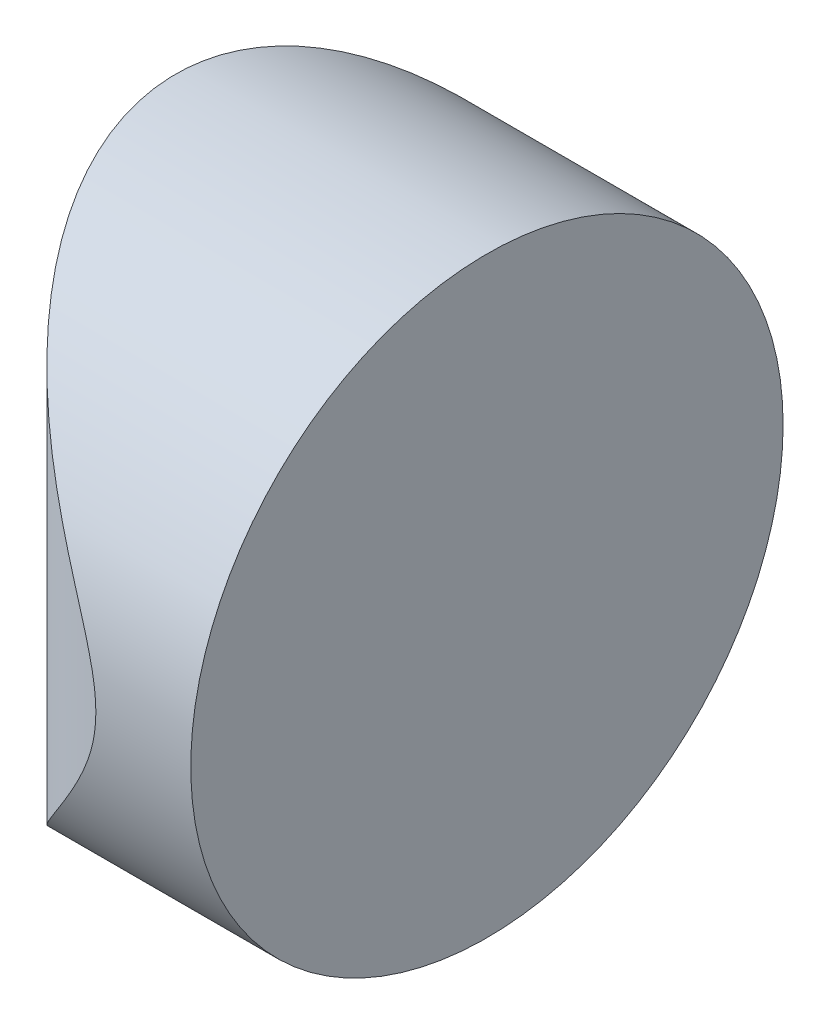
ISO-10303-21;
HEADER;
FILE_DESCRIPTION(('STEP AP214'),'2;1');
FILE_NAME('part.step','',(''),(''),'','','');
FILE_SCHEMA(('AUTOMOTIVE_DESIGN { 1 0 10303 214 1 1 1 1 }'));
ENDSEC;
DATA;
#1=APPLICATION_CONTEXT('core data for automotive mechanical design processes');
#2=APPLICATION_PROTOCOL_DEFINITION('international standard','automotive_design',2000,#1);
#3=PRODUCT_CONTEXT('',#1,'mechanical');
#4=PRODUCT('Part','Part','',(#3));
#5=PRODUCT_RELATED_PRODUCT_CATEGORY('part','',(#4));
#6=PRODUCT_DEFINITION_FORMATION('','',#4);
#7=PRODUCT_DEFINITION_CONTEXT('part definition',#1,'design');
#8=PRODUCT_DEFINITION('design','',#6,#7);
#9=PRODUCT_DEFINITION_SHAPE('','',#8);
#10=(LENGTH_UNIT() NAMED_UNIT(*) SI_UNIT(.MILLI.,.METRE.));
#11=(NAMED_UNIT(*) PLANE_ANGLE_UNIT() SI_UNIT($,.RADIAN.));
#12=(NAMED_UNIT(*) SI_UNIT($,.STERADIAN.) SOLID_ANGLE_UNIT());
#13=UNCERTAINTY_MEASURE_WITH_UNIT(LENGTH_MEASURE(1.E-05),#10,'distance_accuracy_value','');
#14=(GEOMETRIC_REPRESENTATION_CONTEXT(3) GLOBAL_UNCERTAINTY_ASSIGNED_CONTEXT((#13)) GLOBAL_UNIT_ASSIGNED_CONTEXT((#10,
#11,#12)) REPRESENTATION_CONTEXT('',''));
#15=CARTESIAN_POINT('',(0.,0.,0.));
#16=DIRECTION('',(0.,0.,1.));
#17=DIRECTION('',(1.,0.,0.));
#18=AXIS2_PLACEMENT_3D('',#15,#16,#17);
#19=CARTESIAN_POINT('',(4.35520433485127,12.5,0.));
#20=DIRECTION('',(0.,-1.,0.));
#21=DIRECTION('',(0.,0.,-1.));
#22=AXIS2_PLACEMENT_3D('',#19,#20,#21);
#23=CYLINDRICAL_SURFACE('',#22,6.56000000000001);
#24=CARTESIAN_POINT('',(-2.20479566514874,0.,0.));
#25=CARTESIAN_POINT('',(-2.20479625291368,-5.92082555034689E-07,-0.142059010534018));
#26=CARTESIAN_POINT('',(-2.20017270893054,0.0048517407394715,-0.284111139242209));
#27=CARTESIAN_POINT('',(-2.18178602671174,0.024154542778671,-0.566956263310266));
#28=CARTESIAN_POINT('',(-2.16802339820734,0.0386044766909083,-0.707749328450406));
#29=CARTESIAN_POINT('',(-2.13165689488844,0.0768077298210396,-0.986943918142709));
#30=CARTESIAN_POINT('',(-2.10905032856488,0.100563881238307,-1.12534470124092));
#31=CARTESIAN_POINT('',(-2.05546761630831,0.156914510420785,-1.39867286402107));
#32=CARTESIAN_POINT('',(-2.02449116703289,0.18950930851757,-1.53360011762072));
#33=CARTESIAN_POINT('',(-1.95498715422773,0.262717791689279,-1.79824156860047));
#34=CARTESIAN_POINT('',(-1.91651066700604,0.303277249443726,-1.92798424710068));
#35=CARTESIAN_POINT('',(-1.83253289145249,0.39191229783334,-2.18254493964299));
#36=CARTESIAN_POINT('',(-1.78702898841073,0.43999068614221,-2.30736109886902));
#37=CARTESIAN_POINT('',(-1.6409926641342,0.594522590574616,-2.67360661982806));
#38=CARTESIAN_POINT('',(-1.53088768078723,0.711323194513612,-2.90701036703629));
#39=CARTESIAN_POINT('',(-1.32633142605432,0.929312754208702,-3.28409827417413));
#40=CARTESIAN_POINT('',(-1.23687499713673,1.02490927918516,-3.4339077251197));
#41=CARTESIAN_POINT('',(-1.04973115363213,1.22570366780926,-3.72151434707834));
#42=CARTESIAN_POINT('',(-0.952043007877265,1.33090238442398,-3.85931044881028));
#43=CARTESIAN_POINT('',(-0.749736254200656,1.54988467663983,-4.12321689352803));
#44=CARTESIAN_POINT('',(-0.645099370449452,1.66369100971784,-4.24929414456034));
#45=CARTESIAN_POINT('',(-0.430562576921207,1.89859238469098,-4.48953998130713));
#46=CARTESIAN_POINT('',(-0.320663070208145,2.01968686856896,-4.60370947691408));
#47=CARTESIAN_POINT('',(-0.061724065976652,2.30750159283398,-4.85450663335686));
#48=CARTESIAN_POINT('',(0.0887631451208692,2.47660217664253,-4.98691864180841));
#49=CARTESIAN_POINT('',(0.393679043523268,2.82513189042638,-5.23242417594022));
#50=CARTESIAN_POINT('',(0.548110462807381,3.00456829384401,-5.34550386959853));
#51=CARTESIAN_POINT('',(0.857230881446924,3.37337256471669,-5.55267908779364));
#52=CARTESIAN_POINT('',(1.01191910551686,3.56272453597041,-5.64680389284216));
#53=CARTESIAN_POINT('',(1.24042360018869,3.85533951430507,-5.77402508065761));
#54=CARTESIAN_POINT('',(1.31597386269347,3.95426714710162,-5.814091050307));
#55=CARTESIAN_POINT('',(1.46493223882529,4.15544804455678,-5.88955792383036));
#56=CARTESIAN_POINT('',(1.53834071170594,4.25770074532897,-5.92495961361171));
#57=CARTESIAN_POINT('',(1.71027980314714,4.50763659112804,-6.0041740349912));
#58=CARTESIAN_POINT('',(1.80716875437467,4.65719076549025,-6.04571942074678));
#59=CARTESIAN_POINT('',(1.98811089818935,4.96633689991167,-6.11881538167238));
#60=CARTESIAN_POINT('',(2.07218078351492,5.12591541720825,-6.15037901345091));
#61=CARTESIAN_POINT('',(2.19508778075565,5.4096416344101,-6.19439136039744));
#62=CARTESIAN_POINT('',(2.23997195563281,5.53064106547378,-6.20972893739688));
#63=CARTESIAN_POINT('',(2.31083499720102,5.77860775983606,-6.23342633217933));
#64=CARTESIAN_POINT('',(2.33689455417491,5.90554703811158,-6.24181595478361));
#65=CARTESIAN_POINT('',(2.35462526330171,6.0696869278313,-6.24750284590213));
#66=CARTESIAN_POINT('',(2.35754615494581,6.10567517161485,-6.24843722804939));
#67=CARTESIAN_POINT('',(2.36145975062682,6.1777699240307,-6.24968679013889));
#68=CARTESIAN_POINT('',(2.36245219326044,6.21387644803164,-6.25000188613631));
#69=CARTESIAN_POINT('',(2.36240836125188,6.37609187959858,-6.24999341630435));
#70=CARTESIAN_POINT('',(2.35016334526917,6.50239122960155,-6.24612469158845));
#71=CARTESIAN_POINT('',(2.30419448338225,6.75070265004859,-6.23116872210823));
#72=CARTESIAN_POINT('',(2.27038447356865,6.87269544038987,-6.22005251573306));
#73=CARTESIAN_POINT('',(2.19548020073126,7.08751051224141,-6.19438748490862));
#74=CARTESIAN_POINT('',(2.15703414769549,7.18143354282623,-6.18090875010781));
#75=CARTESIAN_POINT('',(2.07296043557898,7.36544464612311,-6.15036408260659));
#76=CARTESIAN_POINT('',(2.02732642272381,7.45552923549066,-6.13329497168436));
#77=CARTESIAN_POINT('',(1.88269680660861,7.72123992487206,-6.07708091433621));
#78=CARTESIAN_POINT('',(1.77622260066177,7.89170243042728,-6.03300857900368));
#79=CARTESIAN_POINT('',(1.53466718968862,8.25120984051277,-5.92441925278788));
#80=CARTESIAN_POINT('',(1.39782888127782,8.43834215206415,-5.85768111438681));
#81=CARTESIAN_POINT('',(1.11904589188707,8.80248707860079,-5.70841321604438));
#82=CARTESIAN_POINT('',(0.977095997786433,8.97948885658742,-5.62586694102945));
#83=CARTESIAN_POINT('',(0.692593195296178,9.32458994854328,-5.44493561510875));
#84=CARTESIAN_POINT('',(0.550040450885347,9.49269153391137,-5.34655463149084));
#85=CARTESIAN_POINT('',(0.267295273967436,9.82025207065174,-5.13360755615895));
#86=CARTESIAN_POINT('',(0.127101590633888,9.97971570841469,-5.01905036479378));
#87=CARTESIAN_POINT('',(-0.128046424412355,10.2664703866162,-4.79152965546709));
#88=CARTESIAN_POINT('',(-0.243647133904536,10.3950131787116,-4.68087559425473));
#89=CARTESIAN_POINT('',(-0.470022363419857,10.6448257714401,-4.44716640343486));
#90=CARTESIAN_POINT('',(-0.580796353390168,10.76609477384,-4.32410991672945));
#91=CARTESIAN_POINT('',(-0.903308478060595,11.1171830663604,-3.9362921630325));
#92=CARTESIAN_POINT('',(-1.10591679728826,11.3350393208933,-3.65229466713834));
#93=CARTESIAN_POINT('',(-1.4265691048085,11.677744754308,-3.11083336623818));
#94=CARTESIAN_POINT('',(-1.55308339496035,11.8122222995253,-2.8645392772419));
#95=CARTESIAN_POINT('',(-1.72151796708661,11.9907178033887,-2.47529435094981));
#96=CARTESIAN_POINT('',(-1.77411941355702,12.0463595389626,-2.34220197278572));
#97=CARTESIAN_POINT('',(-1.8713311239099,12.1490607932554,-2.06995660026932));
#98=CARTESIAN_POINT('',(-1.9159449702918,12.1961241596101,-1.93080635790413));
#99=CARTESIAN_POINT('',(-1.99627503291944,12.2807850666757,-1.6474118360628));
#100=CARTESIAN_POINT('',(-2.03200580706443,12.318398096029,-1.503176339487));
#101=CARTESIAN_POINT('',(-2.09389487861613,12.38350494682,-1.21041208421202));
#102=CARTESIAN_POINT('',(-2.12005334423826,12.4109989460807,-1.06188340100707));
#103=CARTESIAN_POINT('',(-2.16215875484579,12.4552371199756,-0.76190539519158));
#104=CARTESIAN_POINT('',(-2.17811296565385,12.4719889434749,-0.610458229982962));
#105=CARTESIAN_POINT('',(-2.19943068057147,12.494369619633,-0.306004631843895));
#106=CARTESIAN_POINT('',(-2.20479503212271,12.4999993623239,-0.152998324667087));
#107=CARTESIAN_POINT('',(-2.20479625291368,12.5000005920826,0.142059010534009));
#108=CARTESIAN_POINT('',(-2.20017270893054,12.4951482592605,0.284111139242199));
#109=CARTESIAN_POINT('',(-2.18178602671175,12.4758454572213,0.566956263310256));
#110=CARTESIAN_POINT('',(-2.16802339820734,12.4613955233091,0.707749328450396));
#111=CARTESIAN_POINT('',(-2.13165689488844,12.423192270179,0.9869439181427));
#112=CARTESIAN_POINT('',(-2.10905032856488,12.3994361187617,1.12534470124092));
#113=CARTESIAN_POINT('',(-2.05546761630831,12.3430854895792,1.39867286402106));
#114=CARTESIAN_POINT('',(-2.02449116703289,12.3104906914824,1.53360011762071));
#115=CARTESIAN_POINT('',(-1.95498715422774,12.2372822083107,1.79824156860046));
#116=CARTESIAN_POINT('',(-1.91651066700605,12.1967227505563,1.92798424710067));
#117=CARTESIAN_POINT('',(-1.83253289145249,12.1080877021667,2.18254493964298));
#118=CARTESIAN_POINT('',(-1.78702898841073,12.0600093138578,2.30736109886901));
#119=CARTESIAN_POINT('',(-1.64099266413421,11.9054774094254,2.67360661982805));
#120=CARTESIAN_POINT('',(-1.53088768078724,11.7886768054864,2.90701036703628));
#121=CARTESIAN_POINT('',(-1.32633142605432,11.5706872457913,3.28409827417412));
#122=CARTESIAN_POINT('',(-1.23687499713674,11.4750907208148,3.43390772511969));
#123=CARTESIAN_POINT('',(-1.04973115363213,11.2742963321907,3.72151434707833));
#124=CARTESIAN_POINT('',(-0.952043007877271,11.169097615576,3.85931044881027));
#125=CARTESIAN_POINT('',(-0.749736254200662,10.9501153233602,4.12321689352802));
#126=CARTESIAN_POINT('',(-0.64509937044946,10.8363089902822,4.24929414456033));
#127=CARTESIAN_POINT('',(-0.430562576921217,10.601407615309,4.48953998130712));
#128=CARTESIAN_POINT('',(-0.320663070208155,10.480313131431,4.60370947691407));
#129=CARTESIAN_POINT('',(-0.0617240659766631,10.192498407166,4.85450663335685));
#130=CARTESIAN_POINT('',(0.0887631451208586,10.0233978233575,4.9869186418084));
#131=CARTESIAN_POINT('',(0.393679043523255,9.67486810957362,5.23242417594021));
#132=CARTESIAN_POINT('',(0.548110462807364,9.49543170615599,5.34550386959852));
#133=CARTESIAN_POINT('',(0.857230881446905,9.12662743528331,5.55267908779363));
#134=CARTESIAN_POINT('',(1.01191910551684,8.9372754640296,5.64680389284215));
#135=CARTESIAN_POINT('',(1.24042360018867,8.64466048569493,5.7740250806576));
#136=CARTESIAN_POINT('',(1.31597386269344,8.54573285289839,5.81409105030699));
#137=CARTESIAN_POINT('',(1.46493223882526,8.34455195544323,5.88955792383034));
#138=CARTESIAN_POINT('',(1.53834071170592,8.24229925467103,5.9249596136117));
#139=CARTESIAN_POINT('',(1.71027980314712,7.99236340887196,6.00417403499119));
#140=CARTESIAN_POINT('',(1.80716875437464,7.84280923450975,6.04571942074677));
#141=CARTESIAN_POINT('',(1.98811089818933,7.53366310008833,6.11881538167238));
#142=CARTESIAN_POINT('',(2.07218078351489,7.37408458279175,6.1503790134509));
#143=CARTESIAN_POINT('',(2.19508778075562,7.09035836558989,6.19439136039743));
#144=CARTESIAN_POINT('',(2.23997195563278,6.96935893452621,6.20972893739687));
#145=CARTESIAN_POINT('',(2.31083499720099,6.72139224016393,6.23342633217932));
#146=CARTESIAN_POINT('',(2.33689455417489,6.5944529618884,6.2418159547836));
#147=CARTESIAN_POINT('',(2.35462526330168,6.43031307216869,6.24750284590213));
#148=CARTESIAN_POINT('',(2.35754615494578,6.39432482838514,6.24843722804938));
#149=CARTESIAN_POINT('',(2.36145975062679,6.3222300759693,6.24968679013888));
#150=CARTESIAN_POINT('',(2.3624521932604,6.28612355196836,6.2500018861363));
#151=CARTESIAN_POINT('',(2.36240836125184,6.12390812040142,6.24999341630434));
#152=CARTESIAN_POINT('',(2.35016334526914,5.99760877039845,6.24612469158844));
#153=CARTESIAN_POINT('',(2.30419448338221,5.7492973499514,6.23116872210822));
#154=CARTESIAN_POINT('',(2.27038447356861,5.62730455961012,6.22005251573305));
#155=CARTESIAN_POINT('',(2.19548020073123,5.41248948775858,6.19438748490861));
#156=CARTESIAN_POINT('',(2.15703414769546,5.31856645717375,6.1809087501078));
#157=CARTESIAN_POINT('',(2.07296043557894,5.13455535387687,6.15036408260658));
#158=CARTESIAN_POINT('',(2.02732642272377,5.04447076450932,6.13329497168435));
#159=CARTESIAN_POINT('',(1.88269680660857,4.77876007512791,6.0770809143362));
#160=CARTESIAN_POINT('',(1.77622260066173,4.60829756957269,6.03300857900366));
#161=CARTESIAN_POINT('',(1.53466718968858,4.2487901594872,5.92441925278786));
#162=CARTESIAN_POINT('',(1.39782888127778,4.06165784793582,5.85768111438678));
#163=CARTESIAN_POINT('',(1.11904589188702,3.69751292139917,5.70841321604435));
#164=CARTESIAN_POINT('',(0.977095997786382,3.52051114341254,5.62586694102942));
#165=CARTESIAN_POINT('',(0.692593195296123,3.17541005145668,5.44493561510871));
#166=CARTESIAN_POINT('',(0.550040450885294,3.00730846608859,5.3465546314908));
#167=CARTESIAN_POINT('',(0.267295273967382,2.67974792934822,5.13360755615891));
#168=CARTESIAN_POINT('',(0.127101590633833,2.52028429158526,5.01905036479374));
#169=CARTESIAN_POINT('',(-0.128046424412408,2.23352961338375,4.79152965546704));
#170=CARTESIAN_POINT('',(-0.243647133904587,2.10498682128839,4.68087559425469));
#171=CARTESIAN_POINT('',(-0.470022363419903,1.85517422855983,4.44716640343481));
#172=CARTESIAN_POINT('',(-0.580796353390213,1.73390522615994,4.3241099167294));
#173=CARTESIAN_POINT('',(-0.903308478060635,1.38281693363953,3.93629216303245));
#174=CARTESIAN_POINT('',(-1.1059167972883,1.16496067910663,3.65229466713828));
#175=CARTESIAN_POINT('',(-1.42656910480853,0.822255245692019,3.11083336623812));
#176=CARTESIAN_POINT('',(-1.55308339496037,0.68777770047468,2.86453927724185));
#177=CARTESIAN_POINT('',(-1.72151796708663,0.509282196611301,2.47529435094976));
#178=CARTESIAN_POINT('',(-1.77411941355704,0.453640461037345,2.34220197278567));
#179=CARTESIAN_POINT('',(-1.87133112390991,0.350939206744566,2.06995660026927));
#180=CARTESIAN_POINT('',(-1.91594497029181,0.303875840389896,1.93080635790407));
#181=CARTESIAN_POINT('',(-1.99627503291945,0.219214933324264,1.64741183606275));
#182=CARTESIAN_POINT('',(-2.03200580706444,0.181601903970978,1.50317633948696));
#183=CARTESIAN_POINT('',(-2.09389487861613,0.116495053180032,1.21041208421198));
#184=CARTESIAN_POINT('',(-2.12005334423827,0.0890010539192866,1.06188340100704));
#185=CARTESIAN_POINT('',(-2.16215875484579,0.0447628800244204,0.761905395191552));
#186=CARTESIAN_POINT('',(-2.17811296565385,0.0280110565250945,0.610458229982937));
#187=CARTESIAN_POINT('',(-2.19943068057147,0.00563038036702422,0.306004631843877));
#188=CARTESIAN_POINT('',(-2.20479503212271,6.37676122369019E-07,0.152998324667073));
#189=CARTESIAN_POINT('',(-2.20479566514874,0.,0.));
#190=B_SPLINE_CURVE_WITH_KNOTS('',3,(#24,#25,#26,#27,#28,#29,#30,#31,#32,#33,#34,#35,#36,#37,
#38,#39,#40,#41,#42,#43,#44,#45,#46,#47,#48,#49,#50,#51,#52,#53,#54,#55,#56,#57,#58,#59,#60,#61,
#62,#63,#64,#65,#66,#67,#68,#69,#70,#71,#72,#73,#74,#75,#76,#77,#78,#79,#80,#81,#82,#83,#84,#85,
#86,#87,#88,#89,#90,#91,#92,#93,#94,#95,#96,#97,#98,#99,#100,#101,#102,#103,#104,#105,#106,#107,
#108,#109,#110,#111,#112,#113,#114,#115,#116,#117,#118,#119,#120,#121,#122,#123,#124,#125,#126,
#127,#128,#129,#130,#131,#132,#133,#134,#135,#136,#137,#138,#139,#140,#141,#142,#143,#144,#145,
#146,#147,#148,#149,#150,#151,#152,#153,#154,#155,#156,#157,#158,#159,#160,#161,#162,#163,#164,
#165,#166,#167,#168,#169,#170,#171,#172,#173,#174,#175,#176,#177,#178,#179,#180,#181,#182,#183,
#184,#185,#186,#187,#188,#189),.UNSPECIFIED.,.T.,.F.,(4,2,2,2,2,2,2,2,2,2,2,2,2,2,2,2,2,2,2,2,2,
2,2,2,2,2,2,2,2,2,2,2,2,2,2,2,2,2,2,2,2,2,2,2,2,2,2,2,2,2,2,2,2,2,2,2,2,2,2,2,2,2,2,2,2,2,2,2,2,
2,2,2,2,2,2,2,2,2,2,2,2,2,4),(0.,0.426008841889453,0.851993925186942,1.27810875111546,
1.70423902242666,2.12756274335047,2.55104435266337,3.39744227400772,3.99362482547104,
4.58986038773878,5.18773147843228,5.78555685122612,6.57123118300954,7.35746532318759,
8.14247545320607,8.53466250575812,8.92678339204932,9.47511054303928,10.0227174606413,
10.4114929473672,10.7985919262661,10.9069010977246,11.0152249495816,11.3933372154509,
11.7729697914608,12.0796518433528,12.386606523145,13.0025163102733,13.7253673859163,
14.4489777992505,15.1724026424668,15.8954309882452,16.5106474981831,17.1259313995639,
18.3530111578262,19.2727552345252,19.7329068942293,20.1928516525659,20.6520375929469,
21.1112154636059,21.5700660168679,22.0288798496367,22.4548886915261,22.8808737748236,
23.3069886007521,23.7331188720633,24.1564425929871,24.5799242023,25.4263221236444,
26.0225046751077,26.6187402373754,27.2166113280689,27.8144367008628,28.6001110326462,
29.3863451728242,30.1713553028427,30.5635423553948,30.955663241686,31.5039903926759,
32.051597310278,32.4403727970039,32.8274717759027,32.9357809473613,33.0441047992183,
33.4222170650876,33.8018496410975,34.1085316929895,34.4154863727817,35.03139615991,
35.7542472355529,36.4778576488872,37.2012824921035,37.9243108378819,38.5395273478197,
39.1548112492006,40.3818910074629,41.3016350841619,41.761786743866,42.2217315022026,
42.6809174425835,43.1400953132425,43.5989458665045,44.0577596992733),.UNSPECIFIED.);
#191=CARTESIAN_POINT('',(-2.20479566514874,0.,0.));
#192=VERTEX_POINT('',#191);
#193=EDGE_CURVE('E10',#192,#192,#190,.T.);
#194=ORIENTED_EDGE('',*,*,#193,.F.);
#195=EDGE_LOOP('',(#194));
#196=FACE_BOUND('',#195,.T.);
#197=ADVANCED_FACE('F33',(#196),#23,.T.);
#198=CARTESIAN_POINT('',(4.36520433485126,12.5,-6.25000000000001));
#199=DIRECTION('',(1.,0.,0.));
#200=DIRECTION('',(0.,0.,-1.));
#201=AXIS2_PLACEMENT_3D('',#198,#199,#200);
#202=PLANE('',#201);
#203=CARTESIAN_POINT('',(4.36520433485127,6.25,0.));
#204=DIRECTION('',(1.,0.,0.));
#205=DIRECTION('',(0.,0.,-1.));
#206=AXIS2_PLACEMENT_3D('',#203,#204,#205);
#207=CIRCLE('',#206,6.25);
#208=CARTESIAN_POINT('',(4.36520433485126,6.25,-6.25000000000001));
#209=VERTEX_POINT('',#208);
#210=EDGE_CURVE('E43',#209,#209,#207,.T.);
#211=ORIENTED_EDGE('',*,*,#210,.T.);
#212=EDGE_LOOP('',(#211));
#213=FACE_BOUND('',#212,.T.);
#214=ADVANCED_FACE('F35',(#213),#202,.T.);
#215=CARTESIAN_POINT('',(-8.33479566514873,6.25,0.));
#216=DIRECTION('',(1.,0.,0.));
#217=DIRECTION('',(0.,0.,-1.));
#218=AXIS2_PLACEMENT_3D('',#215,#216,#217);
#219=CYLINDRICAL_SURFACE('',#218,6.25);
#220=ORIENTED_EDGE('',*,*,#210,.F.);
#221=EDGE_LOOP('',(#220));
#222=FACE_BOUND('',#221,.T.);
#223=ORIENTED_EDGE('',*,*,#193,.T.);
#224=EDGE_LOOP('',(#223));
#225=FACE_BOUND('',#224,.T.);
#226=ADVANCED_FACE('F50',(#222,#225),#219,.T.);
#227=CLOSED_SHELL('',(#197,#214,#226));
#228=MANIFOLD_SOLID_BREP('B2',#227);
#229=ADVANCED_BREP_SHAPE_REPRESENTATION('',(#18,#228),#14);
#230=SHAPE_DEFINITION_REPRESENTATION(#9,#229);
ENDSEC;
END-ISO-10303-21;
